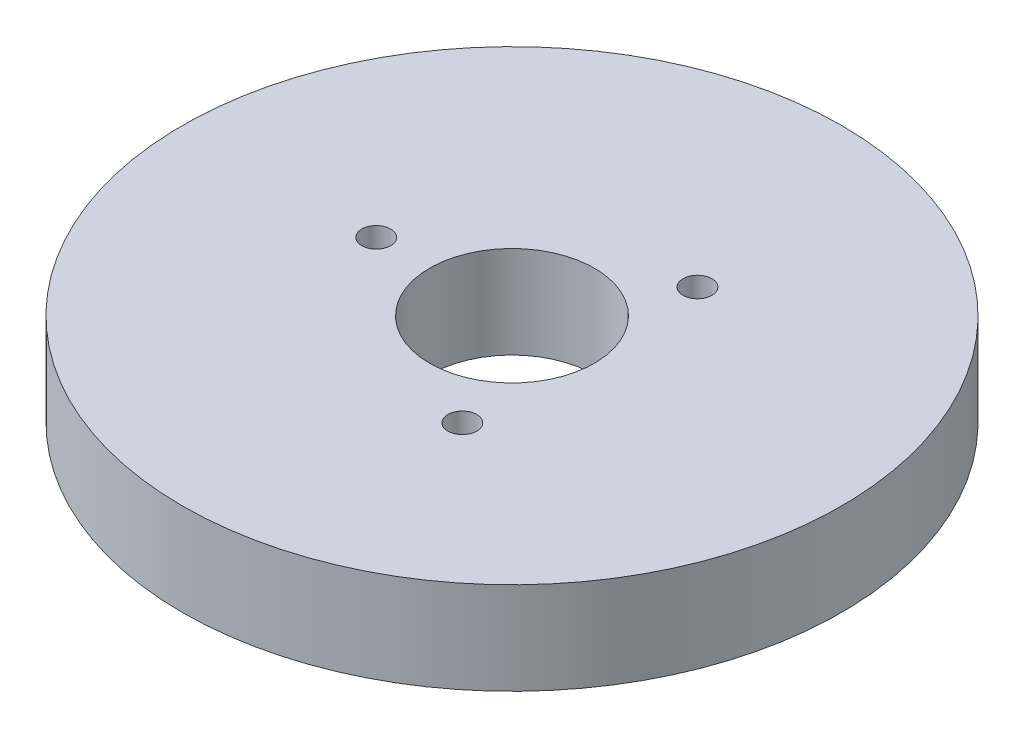
ISO-10303-21;
HEADER;
FILE_DESCRIPTION(('STEP AP214'),'2;1');
FILE_NAME('part.step','',(''),(''),'','','');
FILE_SCHEMA(('AUTOMOTIVE_DESIGN { 1 0 10303 214 1 1 1 1 }'));
ENDSEC;
DATA;
#1=APPLICATION_CONTEXT('core data for automotive mechanical design processes');
#2=APPLICATION_PROTOCOL_DEFINITION('international standard','automotive_design',2000,#1);
#3=PRODUCT_CONTEXT('',#1,'mechanical');
#4=PRODUCT('Part','Part','',(#3));
#5=PRODUCT_RELATED_PRODUCT_CATEGORY('part','',(#4));
#6=PRODUCT_DEFINITION_FORMATION('','',#4);
#7=PRODUCT_DEFINITION_CONTEXT('part definition',#1,'design');
#8=PRODUCT_DEFINITION('design','',#6,#7);
#9=PRODUCT_DEFINITION_SHAPE('','',#8);
#10=(LENGTH_UNIT() NAMED_UNIT(*) SI_UNIT(.MILLI.,.METRE.));
#11=(NAMED_UNIT(*) PLANE_ANGLE_UNIT() SI_UNIT($,.RADIAN.));
#12=(NAMED_UNIT(*) SI_UNIT($,.STERADIAN.) SOLID_ANGLE_UNIT());
#13=UNCERTAINTY_MEASURE_WITH_UNIT(LENGTH_MEASURE(1.E-05),#10,'distance_accuracy_value','');
#14=(GEOMETRIC_REPRESENTATION_CONTEXT(3) GLOBAL_UNCERTAINTY_ASSIGNED_CONTEXT((#13)) GLOBAL_UNIT_ASSIGNED_CONTEXT((#10,
#11,#12)) REPRESENTATION_CONTEXT('',''));
#15=CARTESIAN_POINT('',(0.,0.,0.));
#16=DIRECTION('',(0.,0.,1.));
#17=DIRECTION('',(1.,0.,0.));
#18=AXIS2_PLACEMENT_3D('',#15,#16,#17);
#19=CARTESIAN_POINT('',(0.,28.,0.));
#20=DIRECTION('',(0.,-1.,0.));
#21=DIRECTION('',(0.,0.,-1.));
#22=AXIS2_PLACEMENT_3D('',#19,#20,#21);
#23=CYLINDRICAL_SURFACE('',#22,100.);
#24=CARTESIAN_POINT('',(0.,28.,0.));
#25=DIRECTION('',(0.,1.,0.));
#26=DIRECTION('',(0.,0.,1.));
#27=AXIS2_PLACEMENT_3D('',#24,#25,#26);
#28=CIRCLE('',#27,100.);
#29=CARTESIAN_POINT('',(0.,28.,100.));
#30=VERTEX_POINT('',#29);
#31=EDGE_CURVE('E10',#30,#30,#28,.T.);
#32=ORIENTED_EDGE('',*,*,#31,.F.);
#33=EDGE_LOOP('',(#32));
#34=FACE_BOUND('',#33,.T.);
#35=CARTESIAN_POINT('',(0.,0.,0.));
#36=DIRECTION('',(0.,1.,0.));
#37=DIRECTION('',(0.,0.,1.));
#38=AXIS2_PLACEMENT_3D('',#35,#36,#37);
#39=CIRCLE('',#38,100.);
#40=CARTESIAN_POINT('',(0.,0.,100.));
#41=VERTEX_POINT('',#40);
#42=EDGE_CURVE('E37',#41,#41,#39,.T.);
#43=ORIENTED_EDGE('',*,*,#42,.T.);
#44=EDGE_LOOP('',(#43));
#45=FACE_BOUND('',#44,.T.);
#46=ADVANCED_FACE('F40',(#34,#45),#23,.T.);
#47=CARTESIAN_POINT('',(0.,28.,0.));
#48=DIRECTION('',(0.,1.,0.));
#49=DIRECTION('',(0.,0.,1.));
#50=AXIS2_PLACEMENT_3D('',#47,#48,#49);
#51=PLANE('',#50);
#52=CARTESIAN_POINT('',(20.6008478588179,28.,35.6817151704687));
#53=DIRECTION('',(0.,1.,0.));
#54=DIRECTION('',(0.866025403784436,0.,-0.500000000000004));
#55=AXIS2_PLACEMENT_3D('',#52,#53,#54);
#56=CIRCLE('',#55,4.38657700494777);
#57=CARTESIAN_POINT('',(24.3997349807593,28.,33.4884266679948));
#58=VERTEX_POINT('',#57);
#59=EDGE_CURVE('E70',#58,#58,#56,.T.);
#60=ORIENTED_EDGE('',*,*,#59,.F.);
#61=EDGE_LOOP('',(#60));
#62=FACE_BOUND('',#61,.T.);
#63=CARTESIAN_POINT('',(20.6008478588174,28.,-35.681715170469));
#64=DIRECTION('',(0.,1.,0.));
#65=DIRECTION('',(-0.866025403784443,0.,-0.499999999999992));
#66=AXIS2_PLACEMENT_3D('',#63,#64,#65);
#67=CIRCLE('',#66,4.38657700494777);
#68=CARTESIAN_POINT('',(16.8019607368759,28.,-37.8750036729428));
#69=VERTEX_POINT('',#68);
#70=EDGE_CURVE('E61',#69,#69,#67,.T.);
#71=ORIENTED_EDGE('',*,*,#70,.F.);
#72=EDGE_LOOP('',(#71));
#73=FACE_BOUND('',#72,.T.);
#74=CARTESIAN_POINT('',(-41.2016957176354,28.,0.));
#75=DIRECTION('',(0.,1.,0.));
#76=DIRECTION('',(0.,0.,1.));
#77=AXIS2_PLACEMENT_3D('',#74,#75,#76);
#78=CIRCLE('',#77,4.38657700494777);
#79=CARTESIAN_POINT('',(-41.2016957176354,28.,4.38657700494777));
#80=VERTEX_POINT('',#79);
#81=EDGE_CURVE('E54',#80,#80,#78,.T.);
#82=ORIENTED_EDGE('',*,*,#81,.F.);
#83=EDGE_LOOP('',(#82));
#84=FACE_BOUND('',#83,.T.);
#85=CARTESIAN_POINT('',(0.,28.,0.));
#86=DIRECTION('',(0.,1.,0.));
#87=DIRECTION('',(0.,0.,1.));
#88=AXIS2_PLACEMENT_3D('',#85,#86,#87);
#89=CIRCLE('',#88,25.);
#90=CARTESIAN_POINT('',(0.,28.,25.));
#91=VERTEX_POINT('',#90);
#92=EDGE_CURVE('E50',#91,#91,#89,.T.);
#93=ORIENTED_EDGE('',*,*,#92,.F.);
#94=EDGE_LOOP('',(#93));
#95=FACE_BOUND('',#94,.T.);
#96=ORIENTED_EDGE('',*,*,#31,.T.);
#97=EDGE_LOOP('',(#96));
#98=FACE_BOUND('',#97,.T.);
#99=ADVANCED_FACE('F85',(#62,#73,#84,#95,#98),#51,.T.);
#100=CARTESIAN_POINT('',(0.,0.,0.));
#101=DIRECTION('',(0.,1.,0.));
#102=DIRECTION('',(0.,0.,1.));
#103=AXIS2_PLACEMENT_3D('',#100,#101,#102);
#104=PLANE('',#103);
#105=CARTESIAN_POINT('',(0.,0.,0.));
#106=DIRECTION('',(0.,1.,0.));
#107=DIRECTION('',(0.,0.,1.));
#108=AXIS2_PLACEMENT_3D('',#105,#106,#107);
#109=CIRCLE('',#108,25.);
#110=CARTESIAN_POINT('',(0.,0.,25.));
#111=VERTEX_POINT('',#110);
#112=EDGE_CURVE('E47',#111,#111,#109,.T.);
#113=ORIENTED_EDGE('',*,*,#112,.T.);
#114=EDGE_LOOP('',(#113));
#115=FACE_BOUND('',#114,.T.);
#116=ORIENTED_EDGE('',*,*,#42,.F.);
#117=EDGE_LOOP('',(#116));
#118=FACE_BOUND('',#117,.T.);
#119=ADVANCED_FACE('F84',(#115,#118),#104,.F.);
#120=CARTESIAN_POINT('',(0.,28.,0.));
#121=DIRECTION('',(0.,-1.,0.));
#122=DIRECTION('',(0.,0.,-1.));
#123=AXIS2_PLACEMENT_3D('',#120,#121,#122);
#124=CYLINDRICAL_SURFACE('',#123,25.);
#125=ORIENTED_EDGE('',*,*,#92,.T.);
#126=EDGE_LOOP('',(#125));
#127=FACE_BOUND('',#126,.T.);
#128=ORIENTED_EDGE('',*,*,#112,.F.);
#129=EDGE_LOOP('',(#128));
#130=FACE_BOUND('',#129,.T.);
#131=ADVANCED_FACE('F91',(#127,#130),#124,.F.);
#132=CARTESIAN_POINT('',(-41.2016957176354,4.16231587215491,0.));
#133=DIRECTION('',(0.,1.,0.));
#134=DIRECTION('',(0.,0.,1.));
#135=AXIS2_PLACEMENT_3D('',#132,#133,#134);
#136=CYLINDRICAL_SURFACE('',#135,4.38657700494777);
#137=CARTESIAN_POINT('',(-41.2016957176354,4.16231587215491,0.));
#138=DIRECTION('',(0.,1.,0.));
#139=DIRECTION('',(0.,0.,1.));
#140=AXIS2_PLACEMENT_3D('',#137,#138,#139);
#141=CIRCLE('',#140,4.38657700494777);
#142=CARTESIAN_POINT('',(-41.2016957176354,4.16231587215491,4.38657700494777));
#143=VERTEX_POINT('',#142);
#144=EDGE_CURVE('E55',#143,#143,#141,.T.);
#145=ORIENTED_EDGE('',*,*,#144,.F.);
#146=EDGE_LOOP('',(#145));
#147=FACE_BOUND('',#146,.T.);
#148=ORIENTED_EDGE('',*,*,#81,.T.);
#149=EDGE_LOOP('',(#148));
#150=FACE_BOUND('',#149,.T.);
#151=ADVANCED_FACE('F96',(#147,#150),#136,.F.);
#152=CARTESIAN_POINT('',(-41.2016957176354,4.16231587215491,0.));
#153=DIRECTION('',(0.,1.,0.));
#154=DIRECTION('',(0.,0.,1.));
#155=AXIS2_PLACEMENT_3D('',#152,#153,#154);
#156=PLANE('',#155);
#157=ORIENTED_EDGE('',*,*,#144,.T.);
#158=EDGE_LOOP('',(#157));
#159=FACE_BOUND('',#158,.T.);
#160=ADVANCED_FACE('F127',(#159),#156,.T.);
#161=CARTESIAN_POINT('',(20.6008478588174,4.16231587215491,-35.681715170469));
#162=DIRECTION('',(0.,1.,0.));
#163=DIRECTION('',(0.,0.,1.));
#164=AXIS2_PLACEMENT_3D('',#161,#162,#163);
#165=CYLINDRICAL_SURFACE('',#164,4.38657700494777);
#166=CARTESIAN_POINT('',(20.6008478588174,4.16231587215491,-35.681715170469));
#167=DIRECTION('',(0.,1.,0.));
#168=DIRECTION('',(-0.866025403784443,0.,-0.499999999999992));
#169=AXIS2_PLACEMENT_3D('',#166,#167,#168);
#170=CIRCLE('',#169,4.38657700494777);
#171=CARTESIAN_POINT('',(16.8019607368759,4.16231587215491,-37.8750036729428));
#172=VERTEX_POINT('',#171);
#173=EDGE_CURVE('E63',#172,#172,#170,.T.);
#174=ORIENTED_EDGE('',*,*,#173,.F.);
#175=EDGE_LOOP('',(#174));
#176=FACE_BOUND('',#175,.T.);
#177=ORIENTED_EDGE('',*,*,#70,.T.);
#178=EDGE_LOOP('',(#177));
#179=FACE_BOUND('',#178,.T.);
#180=ADVANCED_FACE('F133',(#176,#179),#165,.F.);
#181=CARTESIAN_POINT('',(20.6008478588174,4.16231587215491,-35.681715170469));
#182=DIRECTION('',(0.,1.,0.));
#183=DIRECTION('',(-0.866025403784443,0.,-0.499999999999992));
#184=AXIS2_PLACEMENT_3D('',#181,#182,#183);
#185=PLANE('',#184);
#186=ORIENTED_EDGE('',*,*,#173,.T.);
#187=EDGE_LOOP('',(#186));
#188=FACE_BOUND('',#187,.T.);
#189=ADVANCED_FACE('F77',(#188),#185,.T.);
#190=CARTESIAN_POINT('',(20.6008478588179,4.16231587215491,35.6817151704687));
#191=DIRECTION('',(0.,1.,0.));
#192=DIRECTION('',(0.,0.,1.));
#193=AXIS2_PLACEMENT_3D('',#190,#191,#192);
#194=CYLINDRICAL_SURFACE('',#193,4.38657700494777);
#195=CARTESIAN_POINT('',(20.6008478588179,4.16231587215491,35.6817151704687));
#196=DIRECTION('',(0.,1.,0.));
#197=DIRECTION('',(0.866025403784436,0.,-0.500000000000004));
#198=AXIS2_PLACEMENT_3D('',#195,#196,#197);
#199=CIRCLE('',#198,4.38657700494777);
#200=CARTESIAN_POINT('',(24.3997349807593,4.16231587215491,33.4884266679948));
#201=VERTEX_POINT('',#200);
#202=EDGE_CURVE('E59',#201,#201,#199,.T.);
#203=ORIENTED_EDGE('',*,*,#202,.F.);
#204=EDGE_LOOP('',(#203));
#205=FACE_BOUND('',#204,.T.);
#206=ORIENTED_EDGE('',*,*,#59,.T.);
#207=EDGE_LOOP('',(#206));
#208=FACE_BOUND('',#207,.T.);
#209=ADVANCED_FACE('F73',(#205,#208),#194,.F.);
#210=CARTESIAN_POINT('',(20.6008478588179,4.16231587215491,35.6817151704687));
#211=DIRECTION('',(0.,1.,0.));
#212=DIRECTION('',(0.866025403784436,0.,-0.500000000000004));
#213=AXIS2_PLACEMENT_3D('',#210,#211,#212);
#214=PLANE('',#213);
#215=ORIENTED_EDGE('',*,*,#202,.T.);
#216=EDGE_LOOP('',(#215));
#217=FACE_BOUND('',#216,.T.);
#218=ADVANCED_FACE('F71',(#217),#214,.T.);
#219=CLOSED_SHELL('',(#46,#99,#119,#131,#151,#160,#180,#189,#209,#218));
#220=MANIFOLD_SOLID_BREP('B2',#219);
#221=ADVANCED_BREP_SHAPE_REPRESENTATION('',(#18,#220),#14);
#222=SHAPE_DEFINITION_REPRESENTATION(#9,#221);
ENDSEC;
END-ISO-10303-21;
